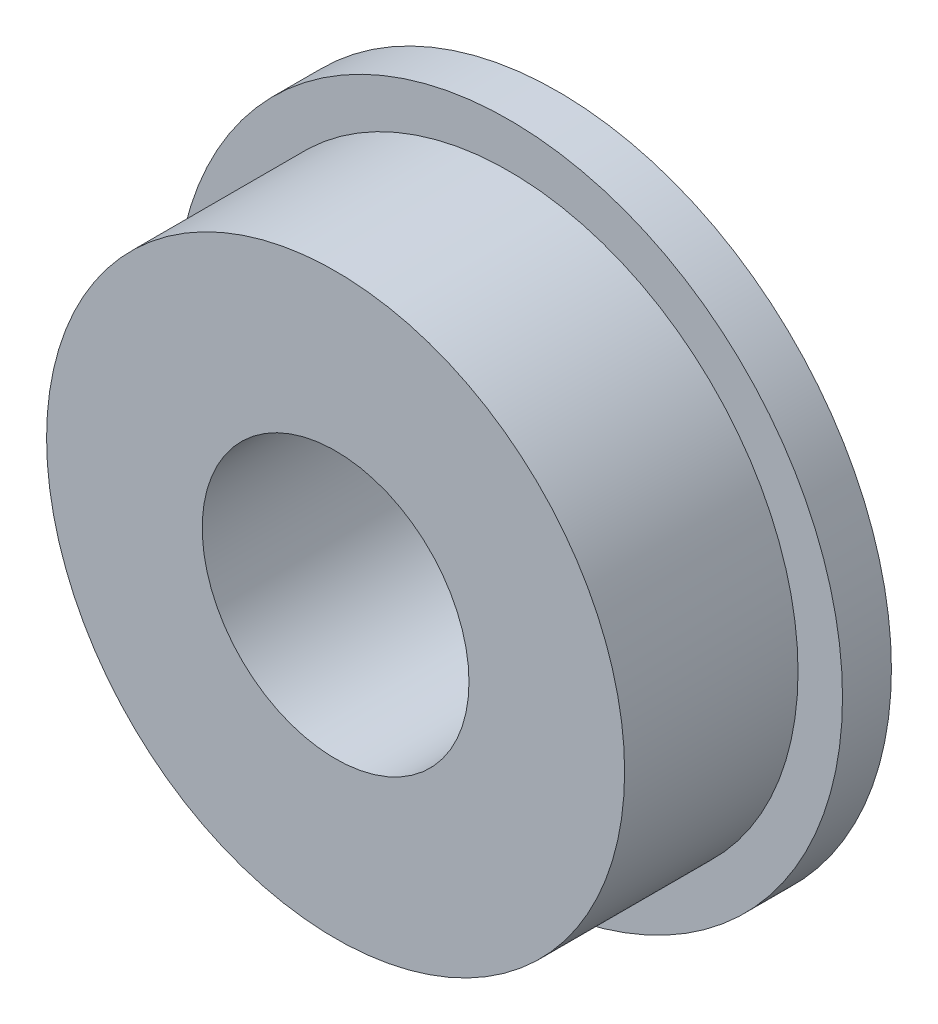
ISO-10303-21;
HEADER;
FILE_DESCRIPTION(('STEP AP214'),'2;1');
FILE_NAME('part.step','',(''),(''),'','','');
FILE_SCHEMA(('AUTOMOTIVE_DESIGN { 1 0 10303 214 1 1 1 1 }'));
ENDSEC;
DATA;
#1=APPLICATION_CONTEXT('core data for automotive mechanical design processes');
#2=APPLICATION_PROTOCOL_DEFINITION('international standard','automotive_design',2000,#1);
#3=PRODUCT_CONTEXT('',#1,'mechanical');
#4=PRODUCT('Part','Part','',(#3));
#5=PRODUCT_RELATED_PRODUCT_CATEGORY('part','',(#4));
#6=PRODUCT_DEFINITION_FORMATION('','',#4);
#7=PRODUCT_DEFINITION_CONTEXT('part definition',#1,'design');
#8=PRODUCT_DEFINITION('design','',#6,#7);
#9=PRODUCT_DEFINITION_SHAPE('','',#8);
#10=(LENGTH_UNIT() NAMED_UNIT(*) SI_UNIT(.MILLI.,.METRE.));
#11=(NAMED_UNIT(*) PLANE_ANGLE_UNIT() SI_UNIT($,.RADIAN.));
#12=(NAMED_UNIT(*) SI_UNIT($,.STERADIAN.) SOLID_ANGLE_UNIT());
#13=UNCERTAINTY_MEASURE_WITH_UNIT(LENGTH_MEASURE(1.E-05),#10,'distance_accuracy_value','');
#14=(GEOMETRIC_REPRESENTATION_CONTEXT(3) GLOBAL_UNCERTAINTY_ASSIGNED_CONTEXT((#13)) GLOBAL_UNIT_ASSIGNED_CONTEXT((#10,
#11,#12)) REPRESENTATION_CONTEXT('',''));
#15=CARTESIAN_POINT('',(0.,0.,0.));
#16=DIRECTION('',(0.,0.,1.));
#17=DIRECTION('',(1.,0.,0.));
#18=AXIS2_PLACEMENT_3D('',#15,#16,#17);
#19=CARTESIAN_POINT('',(0.,0.,5.));
#20=DIRECTION('',(0.,0.,1.));
#21=DIRECTION('',(1.,0.,0.));
#22=AXIS2_PLACEMENT_3D('',#19,#20,#21);
#23=PLANE('',#22);
#24=CARTESIAN_POINT('',(0.,0.,5.));
#25=DIRECTION('',(0.,0.,1.));
#26=DIRECTION('',(1.,0.,0.));
#27=AXIS2_PLACEMENT_3D('',#24,#25,#26);
#28=CIRCLE('',#27,3.);
#29=CARTESIAN_POINT('',(3.,0.,5.));
#30=VERTEX_POINT('',#29);
#31=EDGE_CURVE('E48',#30,#30,#28,.T.);
#32=ORIENTED_EDGE('',*,*,#31,.F.);
#33=EDGE_LOOP('',(#32));
#34=FACE_BOUND('',#33,.T.);
#35=CARTESIAN_POINT('',(0.,0.,5.));
#36=DIRECTION('',(0.,0.,1.));
#37=DIRECTION('',(1.,0.,0.));
#38=AXIS2_PLACEMENT_3D('',#35,#36,#37);
#39=CIRCLE('',#38,6.5);
#40=CARTESIAN_POINT('',(6.5,0.,5.));
#41=VERTEX_POINT('',#40);
#42=EDGE_CURVE('E57',#41,#41,#39,.T.);
#43=ORIENTED_EDGE('',*,*,#42,.T.);
#44=EDGE_LOOP('',(#43));
#45=FACE_BOUND('',#44,.T.);
#46=ADVANCED_FACE('F32',(#34,#45),#23,.T.);
#47=CARTESIAN_POINT('',(0.,0.,5.));
#48=DIRECTION('',(0.,0.,-1.));
#49=DIRECTION('',(-1.,0.,0.));
#50=AXIS2_PLACEMENT_3D('',#47,#48,#49);
#51=CYLINDRICAL_SURFACE('',#50,7.5);
#52=CARTESIAN_POINT('',(0.,0.,0.));
#53=DIRECTION('',(0.,0.,1.));
#54=DIRECTION('',(1.,0.,0.));
#55=AXIS2_PLACEMENT_3D('',#52,#53,#54);
#56=CIRCLE('',#55,7.5);
#57=CARTESIAN_POINT('',(7.5,0.,0.));
#58=VERTEX_POINT('',#57);
#59=EDGE_CURVE('E44',#58,#58,#56,.T.);
#60=ORIENTED_EDGE('',*,*,#59,.T.);
#61=EDGE_LOOP('',(#60));
#62=FACE_BOUND('',#61,.T.);
#63=CARTESIAN_POINT('',(0.,0.,1.1));
#64=DIRECTION('',(0.,0.,1.));
#65=DIRECTION('',(1.,0.,0.));
#66=AXIS2_PLACEMENT_3D('',#63,#64,#65);
#67=CIRCLE('',#66,7.5);
#68=CARTESIAN_POINT('',(7.5,0.,1.1));
#69=VERTEX_POINT('',#68);
#70=EDGE_CURVE('E53',#69,#69,#67,.T.);
#71=ORIENTED_EDGE('',*,*,#70,.F.);
#72=EDGE_LOOP('',(#71));
#73=FACE_BOUND('',#72,.T.);
#74=ADVANCED_FACE('F73',(#62,#73),#51,.T.);
#75=CARTESIAN_POINT('',(0.,0.,0.));
#76=DIRECTION('',(0.,0.,1.));
#77=DIRECTION('',(1.,0.,0.));
#78=AXIS2_PLACEMENT_3D('',#75,#76,#77);
#79=PLANE('',#78);
#80=CARTESIAN_POINT('',(0.,0.,0.));
#81=DIRECTION('',(0.,0.,1.));
#82=DIRECTION('',(1.,0.,0.));
#83=AXIS2_PLACEMENT_3D('',#80,#81,#82);
#84=CIRCLE('',#83,3.11917535925942);
#85=CARTESIAN_POINT('',(3.11917535925942,0.,0.));
#86=VERTEX_POINT('',#85);
#87=EDGE_CURVE('E40',#86,#86,#84,.T.);
#88=ORIENTED_EDGE('',*,*,#87,.T.);
#89=EDGE_LOOP('',(#88));
#90=FACE_BOUND('',#89,.T.);
#91=ORIENTED_EDGE('',*,*,#59,.F.);
#92=EDGE_LOOP('',(#91));
#93=FACE_BOUND('',#92,.T.);
#94=ADVANCED_FACE('F75',(#90,#93),#79,.F.);
#95=CARTESIAN_POINT('',(0.,0.,5.));
#96=DIRECTION('',(0.,0.,-1.));
#97=DIRECTION('',(-1.,0.,0.));
#98=AXIS2_PLACEMENT_3D('',#95,#96,#97);
#99=CYLINDRICAL_SURFACE('',#98,3.);
#100=CARTESIAN_POINT('',(0.,0.,0.0999999999999994));
#101=DIRECTION('',(0.,0.,1.));
#102=DIRECTION('',(1.,0.,0.));
#103=AXIS2_PLACEMENT_3D('',#100,#101,#102);
#104=CIRCLE('',#103,3.);
#105=CARTESIAN_POINT('',(3.,0.,0.0999999999999994));
#106=VERTEX_POINT('',#105);
#107=EDGE_CURVE('E10',#106,#106,#104,.F.);
#108=ORIENTED_EDGE('',*,*,#107,.T.);
#109=EDGE_LOOP('',(#108));
#110=FACE_BOUND('',#109,.T.);
#111=ORIENTED_EDGE('',*,*,#31,.T.);
#112=EDGE_LOOP('',(#111));
#113=FACE_BOUND('',#112,.T.);
#114=ADVANCED_FACE('F69',(#110,#113),#99,.F.);
#115=CARTESIAN_POINT('',(0.,0.,1.1));
#116=DIRECTION('',(0.,0.,1.));
#117=DIRECTION('',(1.,0.,0.));
#118=AXIS2_PLACEMENT_3D('',#115,#116,#117);
#119=PLANE('',#118);
#120=CARTESIAN_POINT('',(0.,0.,1.1));
#121=DIRECTION('',(0.,0.,1.));
#122=DIRECTION('',(1.,0.,0.));
#123=AXIS2_PLACEMENT_3D('',#120,#121,#122);
#124=CIRCLE('',#123,6.5);
#125=CARTESIAN_POINT('',(6.5,0.,1.1));
#126=VERTEX_POINT('',#125);
#127=EDGE_CURVE('E56',#126,#126,#124,.T.);
#128=ORIENTED_EDGE('',*,*,#127,.F.);
#129=EDGE_LOOP('',(#128));
#130=FACE_BOUND('',#129,.T.);
#131=ORIENTED_EDGE('',*,*,#70,.T.);
#132=EDGE_LOOP('',(#131));
#133=FACE_BOUND('',#132,.T.);
#134=ADVANCED_FACE('F66',(#130,#133),#119,.T.);
#135=CARTESIAN_POINT('',(0.,0.,1.1));
#136=DIRECTION('',(0.,0.,1.));
#137=DIRECTION('',(1.,0.,0.));
#138=AXIS2_PLACEMENT_3D('',#135,#136,#137);
#139=CYLINDRICAL_SURFACE('',#138,6.5);
#140=ORIENTED_EDGE('',*,*,#127,.T.);
#141=EDGE_LOOP('',(#140));
#142=FACE_BOUND('',#141,.T.);
#143=ORIENTED_EDGE('',*,*,#42,.F.);
#144=EDGE_LOOP('',(#143));
#145=FACE_BOUND('',#144,.T.);
#146=ADVANCED_FACE('F63',(#142,#145),#139,.T.);
#147=CARTESIAN_POINT('',(0.,0.,0.));
#148=DIRECTION('',(0.,0.,-1.));
#149=DIRECTION('',(-1.,0.,0.));
#150=AXIS2_PLACEMENT_3D('',#147,#148,#149);
#151=CONICAL_SURFACE('',#150,3.11917535925942,0.872664625997164);
#152=ORIENTED_EDGE('',*,*,#107,.F.);
#153=EDGE_LOOP('',(#152));
#154=FACE_BOUND('',#153,.T.);
#155=ORIENTED_EDGE('',*,*,#87,.F.);
#156=EDGE_LOOP('',(#155));
#157=FACE_BOUND('',#156,.T.);
#158=ADVANCED_FACE('F35',(#154,#157),#151,.F.);
#159=CLOSED_SHELL('',(#46,#74,#94,#114,#134,#146,#158));
#160=MANIFOLD_SOLID_BREP('B2',#159);
#161=ADVANCED_BREP_SHAPE_REPRESENTATION('',(#18,#160),#14);
#162=SHAPE_DEFINITION_REPRESENTATION(#9,#161);
ENDSEC;
END-ISO-10303-21;
